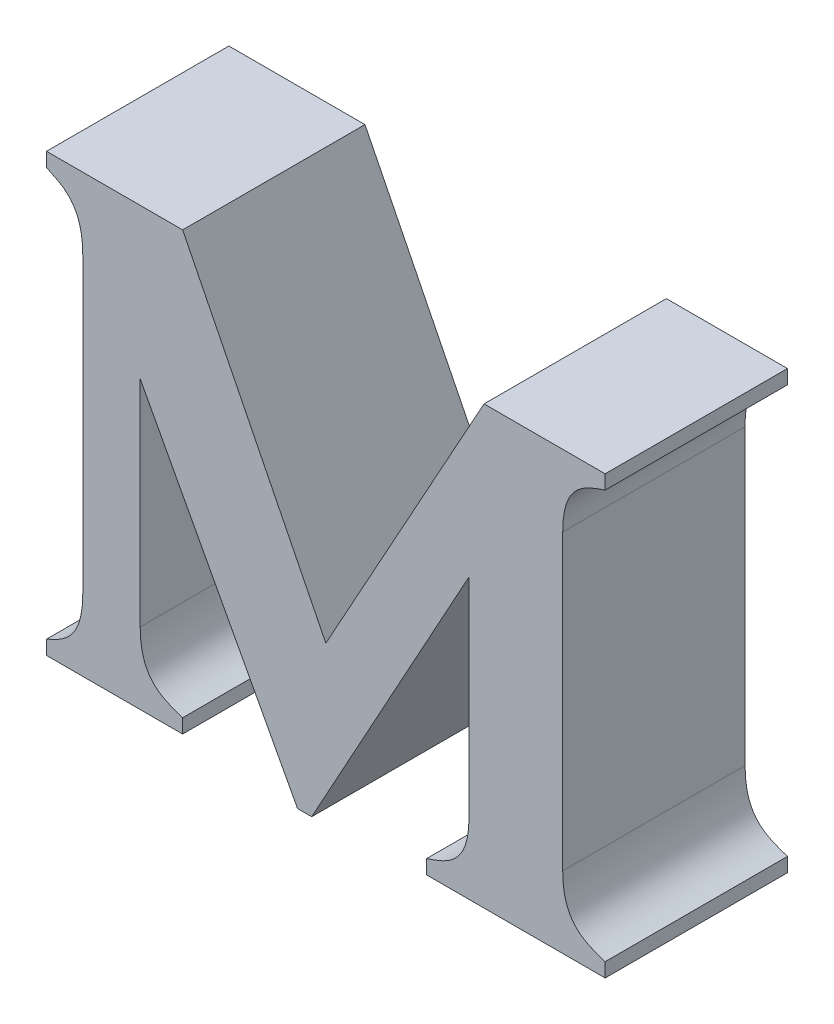
ISO-10303-21;
HEADER;
FILE_DESCRIPTION(('STEP AP214'),'2;1');
FILE_NAME('part.step','',(''),(''),'','','');
FILE_SCHEMA(('AUTOMOTIVE_DESIGN { 1 0 10303 214 1 1 1 1 }'));
ENDSEC;
DATA;
#1=APPLICATION_CONTEXT('core data for automotive mechanical design processes');
#2=APPLICATION_PROTOCOL_DEFINITION('international standard','automotive_design',2000,#1);
#3=PRODUCT_CONTEXT('',#1,'mechanical');
#4=PRODUCT('Part','Part','',(#3));
#5=PRODUCT_RELATED_PRODUCT_CATEGORY('part','',(#4));
#6=PRODUCT_DEFINITION_FORMATION('','',#4);
#7=PRODUCT_DEFINITION_CONTEXT('part definition',#1,'design');
#8=PRODUCT_DEFINITION('design','',#6,#7);
#9=PRODUCT_DEFINITION_SHAPE('','',#8);
#10=(LENGTH_UNIT() NAMED_UNIT(*) SI_UNIT(.MILLI.,.METRE.));
#11=(NAMED_UNIT(*) PLANE_ANGLE_UNIT() SI_UNIT($,.RADIAN.));
#12=(NAMED_UNIT(*) SI_UNIT($,.STERADIAN.) SOLID_ANGLE_UNIT());
#13=UNCERTAINTY_MEASURE_WITH_UNIT(LENGTH_MEASURE(1.E-05),#10,'distance_accuracy_value','');
#14=(GEOMETRIC_REPRESENTATION_CONTEXT(3) GLOBAL_UNCERTAINTY_ASSIGNED_CONTEXT((#13)) GLOBAL_UNIT_ASSIGNED_CONTEXT((#10,
#11,#12)) REPRESENTATION_CONTEXT('',''));
#15=CARTESIAN_POINT('',(0.,0.,0.));
#16=DIRECTION('',(0.,0.,1.));
#17=DIRECTION('',(1.,0.,0.));
#18=AXIS2_PLACEMENT_3D('',#15,#16,#17);
#19=CARTESIAN_POINT('',(3.4975712633282,-0.200329401425036,0.));
#20=CARTESIAN_POINT('',(3.4975712633282,-0.200329401425036,0.1));
#21=CARTESIAN_POINT('',(3.505812727957,-0.204207508825481,0.));
#22=CARTESIAN_POINT('',(3.505812727957,-0.204207508825481,0.1));
#23=CARTESIAN_POINT('',(3.5174478428155,-0.2080857603454,0.));
#24=CARTESIAN_POINT('',(3.5174478428155,-0.2080857603454,0.1));
#25=CARTESIAN_POINT('',(3.5174478428152,-0.231839582517053,0.));
#26=CARTESIAN_POINT('',(3.5174478428152,-0.231839582517053,0.1));
#27=B_SPLINE_SURFACE_WITH_KNOTS('',3,1,((#19,#20),(#21,#22),(#23,#24),(#25,#26)),.UNSPECIFIED.,
.F.,.F.,.F.,(4,4),(2,2),(-1.,0.),(0.,0.01),.UNSPECIFIED.);
#28=CARTESIAN_POINT('',(3.5174478428152,-0.231839582517053,0.));
#29=CARTESIAN_POINT('',(3.5174478428155,-0.2080857603454,0.));
#30=CARTESIAN_POINT('',(3.505812727957,-0.204207508825481,0.));
#31=CARTESIAN_POINT('',(3.4975712633282,-0.200329401425036,0.));
#32=B_SPLINE_CURVE_WITH_KNOTS('',3,(#28,#29,#30,#31),.UNSPECIFIED.,.F.,.F.,(4,4),(0.,1.),.UNSPECIFIED.);
#33=CARTESIAN_POINT('',(3.5174478428152,-0.231839582517053,0.));
#34=VERTEX_POINT('',#33);
#35=CARTESIAN_POINT('',(3.4975712633282,-0.200329401425036,0.));
#36=VERTEX_POINT('',#35);
#37=EDGE_CURVE('E11',#34,#36,#32,.T.);
#38=DIRECTION('',(0.,0.,1.));
#39=VECTOR('',#38,1.);
#40=CARTESIAN_POINT('',(3.5174478428152,-0.231839582517053,0.));
#41=LINE('',#40,#39);
#42=CARTESIAN_POINT('',(3.5174478428152,-0.231839582517053,0.1));
#43=VERTEX_POINT('',#42);
#44=EDGE_CURVE('E28',#34,#43,#41,.T.);
#45=CARTESIAN_POINT('',(3.4975712633282,-0.200329401425036,0.1));
#46=CARTESIAN_POINT('',(3.505812727957,-0.204207508825481,0.1));
#47=CARTESIAN_POINT('',(3.5174478428155,-0.2080857603454,0.1));
#48=CARTESIAN_POINT('',(3.5174478428152,-0.231839582517053,0.1));
#49=B_SPLINE_CURVE_WITH_KNOTS('',3,(#45,#46,#47,#48),.UNSPECIFIED.,.F.,.F.,(4,4),(-1.,0.),.UNSPECIFIED.);
#50=CARTESIAN_POINT('',(3.4975712633282,-0.200329401425036,0.1));
#51=VERTEX_POINT('',#50);
#52=EDGE_CURVE('E206',#51,#43,#49,.T.);
#53=DIRECTION('',(0.,0.,1.));
#54=VECTOR('',#53,1.);
#55=CARTESIAN_POINT('',(3.4975712633282,-0.200329401425036,0.));
#56=LINE('',#55,#54);
#57=EDGE_CURVE('E433',#36,#51,#56,.T.);
#58=ORIENTED_EDGE('',*,*,#37,.F.);
#59=ORIENTED_EDGE('',*,*,#44,.T.);
#60=ORIENTED_EDGE('',*,*,#52,.F.);
#61=ORIENTED_EDGE('',*,*,#57,.F.);
#62=EDGE_LOOP('',(#58,#59,#60,#61));
#63=FACE_BOUND('',#62,.T.);
#64=ADVANCED_FACE('F17',(#63),#27,.T.);
#65=CARTESIAN_POINT('',(3.4975712633282,-0.19257300647474,0.));
#66=DIRECTION('',(-1.,0.,0.));
#67=DIRECTION('',(0.,-1.,0.));
#68=AXIS2_PLACEMENT_3D('',#65,#66,#67);
#69=PLANE('',#68);
#70=DIRECTION('',(0.,1.,0.));
#71=VECTOR('',#70,1.);
#72=CARTESIAN_POINT('',(3.4975712633282,-0.200329401425036,0.));
#73=LINE('',#72,#71);
#74=CARTESIAN_POINT('',(3.4975712633282,-0.19257300647474,0.));
#75=VERTEX_POINT('',#74);
#76=EDGE_CURVE('E431',#36,#75,#73,.T.);
#77=ORIENTED_EDGE('',*,*,#76,.F.);
#78=ORIENTED_EDGE('',*,*,#57,.T.);
#79=DIRECTION('',(0.,-1.,0.));
#80=VECTOR('',#79,1.);
#81=CARTESIAN_POINT('',(3.4975712633282,-0.200329401425036,0.1));
#82=LINE('',#81,#80);
#83=CARTESIAN_POINT('',(3.4975712633282,-0.19257300647474,0.1));
#84=VERTEX_POINT('',#83);
#85=EDGE_CURVE('E429',#84,#51,#82,.T.);
#86=ORIENTED_EDGE('',*,*,#85,.F.);
#87=DIRECTION('',(0.,0.,1.));
#88=VECTOR('',#87,1.);
#89=CARTESIAN_POINT('',(3.4975712633282,-0.19257300647474,0.));
#90=LINE('',#89,#88);
#91=EDGE_CURVE('E426',#75,#84,#90,.T.);
#92=ORIENTED_EDGE('',*,*,#91,.F.);
#93=EDGE_LOOP('',(#77,#78,#86,#92));
#94=FACE_BOUND('',#93,.T.);
#95=ADVANCED_FACE('F528',(#94),#69,.T.);
#96=CARTESIAN_POINT('',(3.5722265241914,-0.19257300647474,0.));
#97=DIRECTION('',(0.,1.,0.));
#98=DIRECTION('',(-1.,0.,0.));
#99=AXIS2_PLACEMENT_3D('',#96,#97,#98);
#100=PLANE('',#99);
#101=DIRECTION('',(1.,0.,0.));
#102=VECTOR('',#101,1.);
#103=CARTESIAN_POINT('',(3.4975712633282,-0.19257300647474,0.));
#104=LINE('',#103,#102);
#105=CARTESIAN_POINT('',(3.5722265241914,-0.19257300647474,0.));
#106=VERTEX_POINT('',#105);
#107=EDGE_CURVE('E424',#75,#106,#104,.T.);
#108=ORIENTED_EDGE('',*,*,#107,.F.);
#109=ORIENTED_EDGE('',*,*,#91,.T.);
#110=DIRECTION('',(-1.,0.,0.));
#111=VECTOR('',#110,1.);
#112=CARTESIAN_POINT('',(3.4975712633282,-0.19257300647474,0.1));
#113=LINE('',#112,#111);
#114=CARTESIAN_POINT('',(3.5722265241914,-0.19257300647474,0.1));
#115=VERTEX_POINT('',#114);
#116=EDGE_CURVE('E421',#115,#84,#113,.T.);
#117=ORIENTED_EDGE('',*,*,#116,.F.);
#118=DIRECTION('',(0.,0.,1.));
#119=VECTOR('',#118,1.);
#120=CARTESIAN_POINT('',(3.5722265241914,-0.19257300647474,0.));
#121=LINE('',#120,#119);
#122=EDGE_CURVE('E418',#106,#115,#121,.T.);
#123=ORIENTED_EDGE('',*,*,#122,.F.);
#124=EDGE_LOOP('',(#108,#109,#117,#123));
#125=FACE_BOUND('',#124,.T.);
#126=ADVANCED_FACE('F524',(#125),#100,.T.);
#127=CARTESIAN_POINT('',(3.6507596762761,-0.349639310644154,0.));
#128=DIRECTION('',(0.894427190999943,0.447213595499905,0.));
#129=DIRECTION('',(-0.447213595499905,0.894427190999943,0.));
#130=AXIS2_PLACEMENT_3D('',#127,#128,#129);
#131=PLANE('',#130);
#132=DIRECTION('',(0.447213595499904,-0.894427190999943,0.));
#133=VECTOR('',#132,1.);
#134=CARTESIAN_POINT('',(3.5722265241914,-0.19257300647474,0.));
#135=LINE('',#134,#133);
#136=CARTESIAN_POINT('',(3.6507596762761,-0.349639310644154,0.));
#137=VERTEX_POINT('',#136);
#138=EDGE_CURVE('E416',#106,#137,#135,.T.);
#139=ORIENTED_EDGE('',*,*,#138,.F.);
#140=ORIENTED_EDGE('',*,*,#122,.T.);
#141=DIRECTION('',(-0.447213595499904,0.894427190999943,0.));
#142=VECTOR('',#141,1.);
#143=CARTESIAN_POINT('',(3.5722265241914,-0.19257300647474,0.1));
#144=LINE('',#143,#142);
#145=CARTESIAN_POINT('',(3.6507596762761,-0.349639310644154,0.1));
#146=VERTEX_POINT('',#145);
#147=EDGE_CURVE('E413',#146,#115,#144,.T.);
#148=ORIENTED_EDGE('',*,*,#147,.F.);
#149=DIRECTION('',(0.,0.,1.));
#150=VECTOR('',#149,1.);
#151=CARTESIAN_POINT('',(3.6507596762761,-0.349639310644154,0.));
#152=LINE('',#151,#150);
#153=EDGE_CURVE('E410',#137,#146,#152,.T.);
#154=ORIENTED_EDGE('',*,*,#153,.F.);
#155=EDGE_LOOP('',(#139,#140,#148,#154));
#156=FACE_BOUND('',#155,.T.);
#157=ADVANCED_FACE('F520',(#156),#131,.T.);
#158=CARTESIAN_POINT('',(3.7375339326907,-0.19257300647474,0.));
#159=DIRECTION('',(-0.875301790518291,0.483577062644077,0.));
#160=DIRECTION('',(-0.483577062644077,-0.875301790518291,0.));
#161=AXIS2_PLACEMENT_3D('',#158,#159,#160);
#162=PLANE('',#161);
#163=DIRECTION('',(0.483577062644076,0.875301790518292,0.));
#164=VECTOR('',#163,1.);
#165=CARTESIAN_POINT('',(3.6507596762761,-0.349639310644154,0.));
#166=LINE('',#165,#164);
#167=CARTESIAN_POINT('',(3.7375339326907,-0.19257300647474,0.));
#168=VERTEX_POINT('',#167);
#169=EDGE_CURVE('E408',#137,#168,#166,.T.);
#170=ORIENTED_EDGE('',*,*,#169,.F.);
#171=ORIENTED_EDGE('',*,*,#153,.T.);
#172=DIRECTION('',(-0.483577062644076,-0.875301790518292,0.));
#173=VECTOR('',#172,1.);
#174=CARTESIAN_POINT('',(3.6507596762761,-0.349639310644154,0.1));
#175=LINE('',#174,#173);
#176=CARTESIAN_POINT('',(3.7375339326907,-0.19257300647474,0.1));
#177=VERTEX_POINT('',#176);
#178=EDGE_CURVE('E405',#177,#146,#175,.T.);
#179=ORIENTED_EDGE('',*,*,#178,.F.);
#180=DIRECTION('',(0.,0.,1.));
#181=VECTOR('',#180,1.);
#182=CARTESIAN_POINT('',(3.7375339326907,-0.19257300647474,0.));
#183=LINE('',#182,#181);
#184=EDGE_CURVE('E402',#168,#177,#183,.T.);
#185=ORIENTED_EDGE('',*,*,#184,.F.);
#186=EDGE_LOOP('',(#170,#171,#179,#185));
#187=FACE_BOUND('',#186,.T.);
#188=ADVANCED_FACE('F516',(#187),#162,.T.);
#189=CARTESIAN_POINT('',(3.8039477289253,-0.19257300647474,0.));
#190=DIRECTION('',(0.,1.,0.));
#191=DIRECTION('',(-1.,0.,0.));
#192=AXIS2_PLACEMENT_3D('',#189,#190,#191);
#193=PLANE('',#192);
#194=DIRECTION('',(1.,0.,0.));
#195=VECTOR('',#194,1.);
#196=CARTESIAN_POINT('',(3.7375339326907,-0.19257300647474,0.));
#197=LINE('',#196,#195);
#198=CARTESIAN_POINT('',(3.8039477289253,-0.19257300647474,0.));
#199=VERTEX_POINT('',#198);
#200=EDGE_CURVE('E400',#168,#199,#197,.T.);
#201=ORIENTED_EDGE('',*,*,#200,.F.);
#202=ORIENTED_EDGE('',*,*,#184,.T.);
#203=DIRECTION('',(-1.,0.,0.));
#204=VECTOR('',#203,1.);
#205=CARTESIAN_POINT('',(3.7375339326907,-0.19257300647474,0.1));
#206=LINE('',#205,#204);
#207=CARTESIAN_POINT('',(3.8039477289253,-0.19257300647474,0.1));
#208=VERTEX_POINT('',#207);
#209=EDGE_CURVE('E397',#208,#177,#206,.T.);
#210=ORIENTED_EDGE('',*,*,#209,.F.);
#211=DIRECTION('',(0.,0.,1.));
#212=VECTOR('',#211,1.);
#213=CARTESIAN_POINT('',(3.8039477289253,-0.19257300647474,0.));
#214=LINE('',#213,#212);
#215=EDGE_CURVE('E394',#199,#208,#214,.T.);
#216=ORIENTED_EDGE('',*,*,#215,.F.);
#217=EDGE_LOOP('',(#201,#202,#210,#216));
#218=FACE_BOUND('',#217,.T.);
#219=ADVANCED_FACE('F512',(#218),#193,.T.);
#220=CARTESIAN_POINT('',(3.8039477289253,-0.200329401425036,0.));
#221=DIRECTION('',(1.,0.,0.));
#222=DIRECTION('',(0.,1.,0.));
#223=AXIS2_PLACEMENT_3D('',#220,#221,#222);
#224=PLANE('',#223);
#225=DIRECTION('',(0.,-1.,0.));
#226=VECTOR('',#225,1.);
#227=CARTESIAN_POINT('',(3.8039477289253,-0.19257300647474,0.));
#228=LINE('',#227,#226);
#229=CARTESIAN_POINT('',(3.8039477289253,-0.200329401425036,0.));
#230=VERTEX_POINT('',#229);
#231=EDGE_CURVE('E392',#199,#230,#228,.T.);
#232=ORIENTED_EDGE('',*,*,#231,.F.);
#233=ORIENTED_EDGE('',*,*,#215,.T.);
#234=DIRECTION('',(0.,1.,0.));
#235=VECTOR('',#234,1.);
#236=CARTESIAN_POINT('',(3.8039477289253,-0.19257300647474,0.1));
#237=LINE('',#236,#235);
#238=CARTESIAN_POINT('',(3.8039477289253,-0.200329401425036,0.1));
#239=VERTEX_POINT('',#238);
#240=EDGE_CURVE('E389',#239,#208,#237,.T.);
#241=ORIENTED_EDGE('',*,*,#240,.F.);
#242=DIRECTION('',(0.,0.,1.));
#243=VECTOR('',#242,1.);
#244=CARTESIAN_POINT('',(3.8039477289253,-0.200329401425036,0.));
#245=LINE('',#244,#243);
#246=EDGE_CURVE('E383',#230,#239,#245,.T.);
#247=ORIENTED_EDGE('',*,*,#246,.F.);
#248=EDGE_LOOP('',(#232,#233,#241,#247));
#249=FACE_BOUND('',#248,.T.);
#250=ADVANCED_FACE('F508',(#249),#224,.T.);
#251=CARTESIAN_POINT('',(3.7806789404027,-0.231839582517053,0.));
#252=CARTESIAN_POINT('',(3.7806789404027,-0.231839582517053,0.1));
#253=CARTESIAN_POINT('',(3.7806789405178,-0.208085760692206,0.));
#254=CARTESIAN_POINT('',(3.7806789405178,-0.208085760692206,0.1));
#255=CARTESIAN_POINT('',(3.7923126141248,-0.204207508998979,0.));
#256=CARTESIAN_POINT('',(3.7923126141248,-0.204207508998979,0.1));
#257=CARTESIAN_POINT('',(3.8039477289253,-0.200329401425036,0.));
#258=CARTESIAN_POINT('',(3.8039477289253,-0.200329401425036,0.1));
#259=B_SPLINE_SURFACE_WITH_KNOTS('',3,1,((#251,#252),(#253,#254),(#255,#256),(#257,#258)),
.UNSPECIFIED.,.F.,.F.,.F.,(4,4),(2,2),(-1.,0.),(0.,0.01),.UNSPECIFIED.);
#260=CARTESIAN_POINT('',(3.8039477289253,-0.200329401425036,0.));
#261=CARTESIAN_POINT('',(3.7923126141248,-0.204207508998979,0.));
#262=CARTESIAN_POINT('',(3.7806789405178,-0.208085760692206,0.));
#263=CARTESIAN_POINT('',(3.7806789404027,-0.231839582517053,0.));
#264=B_SPLINE_CURVE_WITH_KNOTS('',3,(#260,#261,#262,#263),.UNSPECIFIED.,.F.,.F.,(4,4),(0.,1.),.UNSPECIFIED.);
#265=CARTESIAN_POINT('',(3.7806789404027,-0.231839582517053,0.));
#266=VERTEX_POINT('',#265);
#267=EDGE_CURVE('E376',#230,#266,#264,.T.);
#268=CARTESIAN_POINT('',(3.7806789404027,-0.231839582517053,0.1));
#269=CARTESIAN_POINT('',(3.7806789405178,-0.208085760692206,0.1));
#270=CARTESIAN_POINT('',(3.7923126141248,-0.204207508998979,0.1));
#271=CARTESIAN_POINT('',(3.8039477289253,-0.200329401425036,0.1));
#272=B_SPLINE_CURVE_WITH_KNOTS('',3,(#268,#269,#270,#271),.UNSPECIFIED.,.F.,.F.,(4,4),(-1.,0.),.UNSPECIFIED.);
#273=CARTESIAN_POINT('',(3.7806789404027,-0.231839582517053,0.1));
#274=VERTEX_POINT('',#273);
#275=EDGE_CURVE('E371',#274,#239,#272,.T.);
#276=DIRECTION('',(0.,0.,1.));
#277=VECTOR('',#276,1.);
#278=CARTESIAN_POINT('',(3.7806789404027,-0.231839582517053,0.));
#279=LINE('',#278,#277);
#280=EDGE_CURVE('E368',#266,#274,#279,.T.);
#281=ORIENTED_EDGE('',*,*,#267,.F.);
#282=ORIENTED_EDGE('',*,*,#246,.T.);
#283=ORIENTED_EDGE('',*,*,#275,.F.);
#284=ORIENTED_EDGE('',*,*,#280,.F.);
#285=EDGE_LOOP('',(#281,#282,#283,#284));
#286=FACE_BOUND('',#285,.T.);
#287=ADVANCED_FACE('F504',(#286),#259,.T.);
#288=CARTESIAN_POINT('',(3.7806789404027,-0.392784138206144,0.));
#289=DIRECTION('',(1.,0.,0.));
#290=DIRECTION('',(0.,1.,0.));
#291=AXIS2_PLACEMENT_3D('',#288,#289,#290);
#292=PLANE('',#291);
#293=DIRECTION('',(0.,-1.,0.));
#294=VECTOR('',#293,1.);
#295=CARTESIAN_POINT('',(3.7806789404027,-0.231839582517053,0.));
#296=LINE('',#295,#294);
#297=CARTESIAN_POINT('',(3.7806789404027,-0.392784138206144,0.));
#298=VERTEX_POINT('',#297);
#299=EDGE_CURVE('E366',#266,#298,#296,.T.);
#300=ORIENTED_EDGE('',*,*,#299,.F.);
#301=ORIENTED_EDGE('',*,*,#280,.T.);
#302=DIRECTION('',(0.,1.,0.));
#303=VECTOR('',#302,1.);
#304=CARTESIAN_POINT('',(3.7806789404027,-0.231839582517053,0.1));
#305=LINE('',#304,#303);
#306=CARTESIAN_POINT('',(3.7806789404027,-0.392784138206144,0.1));
#307=VERTEX_POINT('',#306);
#308=EDGE_CURVE('E363',#307,#274,#305,.T.);
#309=ORIENTED_EDGE('',*,*,#308,.F.);
#310=DIRECTION('',(0.,0.,1.));
#311=VECTOR('',#310,1.);
#312=CARTESIAN_POINT('',(3.7806789404027,-0.392784138206144,0.));
#313=LINE('',#312,#311);
#314=EDGE_CURVE('E357',#298,#307,#313,.T.);
#315=ORIENTED_EDGE('',*,*,#314,.F.);
#316=EDGE_LOOP('',(#300,#301,#309,#315));
#317=FACE_BOUND('',#316,.T.);
#318=ADVANCED_FACE('F500',(#317),#292,.T.);
#319=CARTESIAN_POINT('',(3.8039477289253,-0.424294319298148,0.));
#320=CARTESIAN_POINT('',(3.8039477289253,-0.424294319298148,0.1));
#321=CARTESIAN_POINT('',(3.7923126138965,-0.42041606784963,0.));
#322=CARTESIAN_POINT('',(3.7923126138965,-0.42041606784963,0.1));
#323=CARTESIAN_POINT('',(3.7806789402565,-0.416537924348321,0.));
#324=CARTESIAN_POINT('',(3.7806789402565,-0.416537924348321,0.1));
#325=CARTESIAN_POINT('',(3.7806789404027,-0.392784138206144,0.));
#326=CARTESIAN_POINT('',(3.7806789404027,-0.392784138206144,0.1));
#327=B_SPLINE_SURFACE_WITH_KNOTS('',3,1,((#319,#320),(#321,#322),(#323,#324),(#325,#326)),
.UNSPECIFIED.,.F.,.F.,.F.,(4,4),(2,2),(-1.,0.),(0.,0.01),.UNSPECIFIED.);
#328=CARTESIAN_POINT('',(3.7806789404027,-0.392784138206144,0.));
#329=CARTESIAN_POINT('',(3.7806789402565,-0.416537924348321,0.));
#330=CARTESIAN_POINT('',(3.7923126138965,-0.42041606784963,0.));
#331=CARTESIAN_POINT('',(3.8039477289253,-0.424294319298148,0.));
#332=B_SPLINE_CURVE_WITH_KNOTS('',3,(#328,#329,#330,#331),.UNSPECIFIED.,.F.,.F.,(4,4),(0.,1.),.UNSPECIFIED.);
#333=CARTESIAN_POINT('',(3.8039477289253,-0.424294319298148,0.));
#334=VERTEX_POINT('',#333);
#335=EDGE_CURVE('E350',#298,#334,#332,.T.);
#336=CARTESIAN_POINT('',(3.8039477289253,-0.424294319298148,0.1));
#337=CARTESIAN_POINT('',(3.7923126138965,-0.42041606784963,0.1));
#338=CARTESIAN_POINT('',(3.7806789402565,-0.416537924348321,0.1));
#339=CARTESIAN_POINT('',(3.7806789404027,-0.392784138206144,0.1));
#340=B_SPLINE_CURVE_WITH_KNOTS('',3,(#336,#337,#338,#339),.UNSPECIFIED.,.F.,.F.,(4,4),(-1.,0.),.UNSPECIFIED.);
#341=CARTESIAN_POINT('',(3.8039477289253,-0.424294319298148,0.1));
#342=VERTEX_POINT('',#341);
#343=EDGE_CURVE('E345',#342,#307,#340,.T.);
#344=DIRECTION('',(0.,0.,1.));
#345=VECTOR('',#344,1.);
#346=CARTESIAN_POINT('',(3.8039477289253,-0.424294319298148,0.));
#347=LINE('',#346,#345);
#348=EDGE_CURVE('E342',#334,#342,#347,.T.);
#349=ORIENTED_EDGE('',*,*,#335,.F.);
#350=ORIENTED_EDGE('',*,*,#314,.T.);
#351=ORIENTED_EDGE('',*,*,#343,.F.);
#352=ORIENTED_EDGE('',*,*,#348,.F.);
#353=EDGE_LOOP('',(#349,#350,#351,#352));
#354=FACE_BOUND('',#353,.T.);
#355=ADVANCED_FACE('F496',(#354),#327,.T.);
#356=CARTESIAN_POINT('',(3.8039477289253,-0.432050714249068,0.));
#357=DIRECTION('',(1.,0.,0.));
#358=DIRECTION('',(0.,1.,0.));
#359=AXIS2_PLACEMENT_3D('',#356,#357,#358);
#360=PLANE('',#359);
#361=DIRECTION('',(0.,-1.,0.));
#362=VECTOR('',#361,1.);
#363=CARTESIAN_POINT('',(3.8039477289253,-0.424294319298148,0.));
#364=LINE('',#363,#362);
#365=CARTESIAN_POINT('',(3.8039477289253,-0.432050714249068,0.));
#366=VERTEX_POINT('',#365);
#367=EDGE_CURVE('E340',#334,#366,#364,.T.);
#368=ORIENTED_EDGE('',*,*,#367,.F.);
#369=ORIENTED_EDGE('',*,*,#348,.T.);
#370=DIRECTION('',(0.,1.,0.));
#371=VECTOR('',#370,1.);
#372=CARTESIAN_POINT('',(3.8039477289253,-0.424294319298148,0.1));
#373=LINE('',#372,#371);
#374=CARTESIAN_POINT('',(3.8039477289253,-0.432050714249068,0.1));
#375=VERTEX_POINT('',#374);
#376=EDGE_CURVE('E337',#375,#342,#373,.T.);
#377=ORIENTED_EDGE('',*,*,#376,.F.);
#378=DIRECTION('',(0.,0.,1.));
#379=VECTOR('',#378,1.);
#380=CARTESIAN_POINT('',(3.8039477289253,-0.432050714249068,0.));
#381=LINE('',#380,#379);
#382=EDGE_CURVE('E334',#366,#375,#381,.T.);
#383=ORIENTED_EDGE('',*,*,#382,.F.);
#384=EDGE_LOOP('',(#368,#369,#377,#383));
#385=FACE_BOUND('',#384,.T.);
#386=ADVANCED_FACE('F492',(#385),#360,.T.);
#387=CARTESIAN_POINT('',(3.7060236795394,-0.432050714249068,0.));
#388=DIRECTION('',(0.,-1.,0.));
#389=DIRECTION('',(1.,0.,0.));
#390=AXIS2_PLACEMENT_3D('',#387,#388,#389);
#391=PLANE('',#390);
#392=DIRECTION('',(-1.,0.,0.));
#393=VECTOR('',#392,1.);
#394=CARTESIAN_POINT('',(3.8039477289253,-0.432050714249068,0.));
#395=LINE('',#394,#393);
#396=CARTESIAN_POINT('',(3.7060236795394,-0.432050714249068,0.));
#397=VERTEX_POINT('',#396);
#398=EDGE_CURVE('E332',#366,#397,#395,.T.);
#399=ORIENTED_EDGE('',*,*,#398,.F.);
#400=ORIENTED_EDGE('',*,*,#382,.T.);
#401=DIRECTION('',(1.,0.,0.));
#402=VECTOR('',#401,1.);
#403=CARTESIAN_POINT('',(3.8039477289253,-0.432050714249068,0.1));
#404=LINE('',#403,#402);
#405=CARTESIAN_POINT('',(3.7060236795394,-0.432050714249068,0.1));
#406=VERTEX_POINT('',#405);
#407=EDGE_CURVE('E329',#406,#375,#404,.T.);
#408=ORIENTED_EDGE('',*,*,#407,.F.);
#409=DIRECTION('',(0.,0.,1.));
#410=VECTOR('',#409,1.);
#411=CARTESIAN_POINT('',(3.7060236795394,-0.432050714249068,0.));
#412=LINE('',#411,#410);
#413=EDGE_CURVE('E326',#397,#406,#412,.T.);
#414=ORIENTED_EDGE('',*,*,#413,.F.);
#415=EDGE_LOOP('',(#399,#400,#408,#414));
#416=FACE_BOUND('',#415,.T.);
#417=ADVANCED_FACE('F488',(#416),#391,.T.);
#418=CARTESIAN_POINT('',(3.7060236795394,-0.424294319298148,0.));
#419=DIRECTION('',(-1.,0.,0.));
#420=DIRECTION('',(0.,-1.,0.));
#421=AXIS2_PLACEMENT_3D('',#418,#419,#420);
#422=PLANE('',#421);
#423=DIRECTION('',(0.,1.,0.));
#424=VECTOR('',#423,1.);
#425=CARTESIAN_POINT('',(3.7060236795394,-0.432050714249068,0.));
#426=LINE('',#425,#424);
#427=CARTESIAN_POINT('',(3.7060236795394,-0.424294319298148,0.));
#428=VERTEX_POINT('',#427);
#429=EDGE_CURVE('E324',#397,#428,#426,.T.);
#430=ORIENTED_EDGE('',*,*,#429,.F.);
#431=ORIENTED_EDGE('',*,*,#413,.T.);
#432=DIRECTION('',(0.,-1.,0.));
#433=VECTOR('',#432,1.);
#434=CARTESIAN_POINT('',(3.7060236795394,-0.432050714249068,0.1));
#435=LINE('',#434,#433);
#436=CARTESIAN_POINT('',(3.7060236795394,-0.424294319298148,0.1));
#437=VERTEX_POINT('',#436);
#438=EDGE_CURVE('E321',#437,#406,#435,.T.);
#439=ORIENTED_EDGE('',*,*,#438,.F.);
#440=DIRECTION('',(0.,0.,1.));
#441=VECTOR('',#440,1.);
#442=CARTESIAN_POINT('',(3.7060236795394,-0.424294319298148,0.));
#443=LINE('',#442,#441);
#444=EDGE_CURVE('E315',#428,#437,#443,.T.);
#445=ORIENTED_EDGE('',*,*,#444,.F.);
#446=EDGE_LOOP('',(#430,#431,#439,#445));
#447=FACE_BOUND('',#446,.T.);
#448=ADVANCED_FACE('F484',(#447),#422,.T.);
#449=CARTESIAN_POINT('',(3.729292468062,-0.392784138206144,0.));
#450=CARTESIAN_POINT('',(3.729292468062,-0.392784138206144,0.1));
#451=CARTESIAN_POINT('',(3.7292924679462,-0.416537924001519,0.));
#452=CARTESIAN_POINT('',(3.7292924679462,-0.416537924001519,0.1));
#453=CARTESIAN_POINT('',(3.7176587943397,-0.420416067604473,0.));
#454=CARTESIAN_POINT('',(3.7176587943397,-0.420416067604473,0.1));
#455=CARTESIAN_POINT('',(3.7060236795394,-0.424294319298148,0.));
#456=CARTESIAN_POINT('',(3.7060236795394,-0.424294319298148,0.1));
#457=B_SPLINE_SURFACE_WITH_KNOTS('',3,1,((#449,#450),(#451,#452),(#453,#454),(#455,#456)),
.UNSPECIFIED.,.F.,.F.,.F.,(4,4),(2,2),(-1.,0.),(0.,0.01),.UNSPECIFIED.);
#458=CARTESIAN_POINT('',(3.7060236795394,-0.424294319298148,0.));
#459=CARTESIAN_POINT('',(3.7176587943397,-0.420416067604473,0.));
#460=CARTESIAN_POINT('',(3.7292924679462,-0.416537924001519,0.));
#461=CARTESIAN_POINT('',(3.729292468062,-0.392784138206144,0.));
#462=B_SPLINE_CURVE_WITH_KNOTS('',3,(#458,#459,#460,#461),.UNSPECIFIED.,.F.,.F.,(4,4),(0.,1.),.UNSPECIFIED.);
#463=CARTESIAN_POINT('',(3.729292468062,-0.392784138206144,0.));
#464=VERTEX_POINT('',#463);
#465=EDGE_CURVE('E308',#428,#464,#462,.T.);
#466=CARTESIAN_POINT('',(3.729292468062,-0.392784138206144,0.1));
#467=CARTESIAN_POINT('',(3.7292924679462,-0.416537924001519,0.1));
#468=CARTESIAN_POINT('',(3.7176587943397,-0.420416067604473,0.1));
#469=CARTESIAN_POINT('',(3.7060236795394,-0.424294319298148,0.1));
#470=B_SPLINE_CURVE_WITH_KNOTS('',3,(#466,#467,#468,#469),.UNSPECIFIED.,.F.,.F.,(4,4),(-1.,0.),.UNSPECIFIED.);
#471=CARTESIAN_POINT('',(3.729292468062,-0.392784138206144,0.1));
#472=VERTEX_POINT('',#471);
#473=EDGE_CURVE('E303',#472,#437,#470,.T.);
#474=DIRECTION('',(0.,0.,1.));
#475=VECTOR('',#474,1.);
#476=CARTESIAN_POINT('',(3.729292468062,-0.392784138206144,0.));
#477=LINE('',#476,#475);
#478=EDGE_CURVE('E300',#464,#472,#477,.T.);
#479=ORIENTED_EDGE('',*,*,#465,.F.);
#480=ORIENTED_EDGE('',*,*,#444,.T.);
#481=ORIENTED_EDGE('',*,*,#473,.F.);
#482=ORIENTED_EDGE('',*,*,#478,.F.);
#483=EDGE_LOOP('',(#479,#480,#481,#482));
#484=FACE_BOUND('',#483,.T.);
#485=ADVANCED_FACE('F480',(#484),#457,.T.);
#486=CARTESIAN_POINT('',(3.729292468062,-0.278862517480154,0.));
#487=DIRECTION('',(-1.,0.,0.));
#488=DIRECTION('',(0.,-1.,0.));
#489=AXIS2_PLACEMENT_3D('',#486,#487,#488);
#490=PLANE('',#489);
#491=DIRECTION('',(0.,1.,0.));
#492=VECTOR('',#491,1.);
#493=CARTESIAN_POINT('',(3.729292468062,-0.392784138206144,0.));
#494=LINE('',#493,#492);
#495=CARTESIAN_POINT('',(3.729292468062,-0.278862517480154,0.));
#496=VERTEX_POINT('',#495);
#497=EDGE_CURVE('E298',#464,#496,#494,.T.);
#498=ORIENTED_EDGE('',*,*,#497,.F.);
#499=ORIENTED_EDGE('',*,*,#478,.T.);
#500=DIRECTION('',(0.,-1.,0.));
#501=VECTOR('',#500,1.);
#502=CARTESIAN_POINT('',(3.729292468062,-0.392784138206144,0.1));
#503=LINE('',#502,#501);
#504=CARTESIAN_POINT('',(3.729292468062,-0.278862517480154,0.1));
#505=VERTEX_POINT('',#504);
#506=EDGE_CURVE('E295',#505,#472,#503,.T.);
#507=ORIENTED_EDGE('',*,*,#506,.F.);
#508=DIRECTION('',(0.,0.,1.));
#509=VECTOR('',#508,1.);
#510=CARTESIAN_POINT('',(3.729292468062,-0.278862517480154,0.));
#511=LINE('',#510,#509);
#512=EDGE_CURVE('E292',#496,#505,#511,.T.);
#513=ORIENTED_EDGE('',*,*,#512,.F.);
#514=EDGE_LOOP('',(#498,#499,#507,#513));
#515=FACE_BOUND('',#514,.T.);
#516=ADVANCED_FACE('F476',(#515),#490,.T.);
#517=CARTESIAN_POINT('',(3.6430031732357,-0.435928821649544,0.));
#518=DIRECTION('',(0.876444775107035,-0.481502394789039,0.));
#519=DIRECTION('',(0.481502394789039,0.876444775107035,0.));
#520=AXIS2_PLACEMENT_3D('',#517,#518,#519);
#521=PLANE('',#520);
#522=DIRECTION('',(-0.481502394789039,-0.876444775107035,0.));
#523=VECTOR('',#522,1.);
#524=CARTESIAN_POINT('',(3.729292468062,-0.278862517480154,0.));
#525=LINE('',#524,#523);
#526=CARTESIAN_POINT('',(3.6430031732357,-0.435928821649544,0.));
#527=VERTEX_POINT('',#526);
#528=EDGE_CURVE('E290',#496,#527,#525,.T.);
#529=ORIENTED_EDGE('',*,*,#528,.F.);
#530=ORIENTED_EDGE('',*,*,#512,.T.);
#531=DIRECTION('',(0.481502394789039,0.876444775107035,0.));
#532=VECTOR('',#531,1.);
#533=CARTESIAN_POINT('',(3.729292468062,-0.278862517480154,0.1));
#534=LINE('',#533,#532);
#535=CARTESIAN_POINT('',(3.6430031732357,-0.435928821649544,0.1));
#536=VERTEX_POINT('',#535);
#537=EDGE_CURVE('E287',#536,#505,#534,.T.);
#538=ORIENTED_EDGE('',*,*,#537,.F.);
#539=DIRECTION('',(0.,0.,1.));
#540=VECTOR('',#539,1.);
#541=CARTESIAN_POINT('',(3.6430031732357,-0.435928821649544,0.));
#542=LINE('',#541,#540);
#543=EDGE_CURVE('E284',#527,#536,#542,.T.);
#544=ORIENTED_EDGE('',*,*,#543,.F.);
#545=EDGE_LOOP('',(#529,#530,#538,#544));
#546=FACE_BOUND('',#545,.T.);
#547=ADVANCED_FACE('F472',(#546),#521,.T.);
#548=CARTESIAN_POINT('',(3.635247030494,-0.435928821649544,0.));
#549=DIRECTION('',(0.,-1.,0.));
#550=DIRECTION('',(1.,0.,0.));
#551=AXIS2_PLACEMENT_3D('',#548,#549,#550);
#552=PLANE('',#551);
#553=DIRECTION('',(-1.,0.,0.));
#554=VECTOR('',#553,1.);
#555=CARTESIAN_POINT('',(3.6430031732357,-0.435928821649544,0.));
#556=LINE('',#555,#554);
#557=CARTESIAN_POINT('',(3.635247030494,-0.435928821649544,0.));
#558=VERTEX_POINT('',#557);
#559=EDGE_CURVE('E282',#527,#558,#556,.T.);
#560=ORIENTED_EDGE('',*,*,#559,.F.);
#561=ORIENTED_EDGE('',*,*,#543,.T.);
#562=DIRECTION('',(1.,0.,0.));
#563=VECTOR('',#562,1.);
#564=CARTESIAN_POINT('',(3.6430031732357,-0.435928821649544,0.1));
#565=LINE('',#564,#563);
#566=CARTESIAN_POINT('',(3.635247030494,-0.435928821649544,0.1));
#567=VERTEX_POINT('',#566);
#568=EDGE_CURVE('E279',#567,#536,#565,.T.);
#569=ORIENTED_EDGE('',*,*,#568,.F.);
#570=DIRECTION('',(0.,0.,1.));
#571=VECTOR('',#570,1.);
#572=CARTESIAN_POINT('',(3.635247030494,-0.435928821649544,0.));
#573=LINE('',#572,#571);
#574=EDGE_CURVE('E276',#558,#567,#573,.T.);
#575=ORIENTED_EDGE('',*,*,#574,.F.);
#576=EDGE_LOOP('',(#560,#561,#569,#575));
#577=FACE_BOUND('',#576,.T.);
#578=ADVANCED_FACE('F468',(#577),#552,.T.);
#579=CARTESIAN_POINT('',(3.5489580959665,-0.274984410079678,0.));
#580=DIRECTION('',(-0.881323295859112,-0.472513754483435,0.));
#581=DIRECTION('',(0.472513754483435,-0.881323295859112,0.));
#582=AXIS2_PLACEMENT_3D('',#579,#580,#581);
#583=PLANE('',#582);
#584=DIRECTION('',(-0.472513754483435,0.881323295859112,0.));
#585=VECTOR('',#584,1.);
#586=CARTESIAN_POINT('',(3.635247030494,-0.435928821649544,0.));
#587=LINE('',#586,#585);
#588=CARTESIAN_POINT('',(3.5489580959665,-0.274984410079678,0.));
#589=VERTEX_POINT('',#588);
#590=EDGE_CURVE('E274',#558,#589,#587,.T.);
#591=ORIENTED_EDGE('',*,*,#590,.F.);
#592=ORIENTED_EDGE('',*,*,#574,.T.);
#593=DIRECTION('',(0.472513754483435,-0.881323295859112,0.));
#594=VECTOR('',#593,1.);
#595=CARTESIAN_POINT('',(3.635247030494,-0.435928821649544,0.1));
#596=LINE('',#595,#594);
#597=CARTESIAN_POINT('',(3.5489580959665,-0.274984410079678,0.1));
#598=VERTEX_POINT('',#597);
#599=EDGE_CURVE('E271',#598,#567,#596,.T.);
#600=ORIENTED_EDGE('',*,*,#599,.F.);
#601=DIRECTION('',(0.,0.,1.));
#602=VECTOR('',#601,1.);
#603=CARTESIAN_POINT('',(3.5489580959665,-0.274984410079678,0.));
#604=LINE('',#603,#602);
#605=EDGE_CURVE('E268',#589,#598,#604,.T.);
#606=ORIENTED_EDGE('',*,*,#605,.F.);
#607=EDGE_LOOP('',(#591,#592,#600,#606));
#608=FACE_BOUND('',#607,.T.);
#609=ADVANCED_FACE('F464',(#608),#583,.T.);
#610=CARTESIAN_POINT('',(3.5489580959665,-0.392784138206144,0.));
#611=DIRECTION('',(1.,0.,0.));
#612=DIRECTION('',(0.,1.,0.));
#613=AXIS2_PLACEMENT_3D('',#610,#611,#612);
#614=PLANE('',#613);
#615=DIRECTION('',(0.,-1.,0.));
#616=VECTOR('',#615,1.);
#617=CARTESIAN_POINT('',(3.5489580959665,-0.274984410079678,0.));
#618=LINE('',#617,#616);
#619=CARTESIAN_POINT('',(3.5489580959665,-0.392784138206144,0.));
#620=VERTEX_POINT('',#619);
#621=EDGE_CURVE('E266',#589,#620,#618,.T.);
#622=ORIENTED_EDGE('',*,*,#621,.F.);
#623=ORIENTED_EDGE('',*,*,#605,.T.);
#624=DIRECTION('',(0.,1.,0.));
#625=VECTOR('',#624,1.);
#626=CARTESIAN_POINT('',(3.5489580959665,-0.274984410079678,0.1));
#627=LINE('',#626,#625);
#628=CARTESIAN_POINT('',(3.5489580959665,-0.392784138206144,0.1));
#629=VERTEX_POINT('',#628);
#630=EDGE_CURVE('E263',#629,#598,#627,.T.);
#631=ORIENTED_EDGE('',*,*,#630,.F.);
#632=DIRECTION('',(0.,0.,1.));
#633=VECTOR('',#632,1.);
#634=CARTESIAN_POINT('',(3.5489580959665,-0.392784138206144,0.));
#635=LINE('',#634,#633);
#636=EDGE_CURVE('E257',#620,#629,#635,.T.);
#637=ORIENTED_EDGE('',*,*,#636,.F.);
#638=EDGE_LOOP('',(#622,#623,#631,#637));
#639=FACE_BOUND('',#638,.T.);
#640=ADVANCED_FACE('F460',(#639),#614,.T.);
#641=CARTESIAN_POINT('',(3.5722265241914,-0.424294319298148,0.));
#642=CARTESIAN_POINT('',(3.5722265241914,-0.424294319298148,0.1));
#643=CARTESIAN_POINT('',(3.5605914077565,-0.420416068441476,0.));
#644=CARTESIAN_POINT('',(3.5605914077565,-0.420416068441476,0.1));
#645=CARTESIAN_POINT('',(3.5489580946111,-0.41653792434832,0.));
#646=CARTESIAN_POINT('',(3.5489580946111,-0.41653792434832,0.1));
#647=CARTESIAN_POINT('',(3.5489580959665,-0.392784138206144,0.));
#648=CARTESIAN_POINT('',(3.5489580959665,-0.392784138206144,0.1));
#649=B_SPLINE_SURFACE_WITH_KNOTS('',3,1,((#641,#642),(#643,#644),(#645,#646),(#647,#648)),
.UNSPECIFIED.,.F.,.F.,.F.,(4,4),(2,2),(-1.,0.),(0.,0.01),.UNSPECIFIED.);
#650=CARTESIAN_POINT('',(3.5489580959665,-0.392784138206144,0.));
#651=CARTESIAN_POINT('',(3.5489580946111,-0.41653792434832,0.));
#652=CARTESIAN_POINT('',(3.5605914077565,-0.420416068441476,0.));
#653=CARTESIAN_POINT('',(3.5722265241914,-0.424294319298148,0.));
#654=B_SPLINE_CURVE_WITH_KNOTS('',3,(#650,#651,#652,#653),.UNSPECIFIED.,.F.,.F.,(4,4),(0.,1.),.UNSPECIFIED.);
#655=CARTESIAN_POINT('',(3.5722265241914,-0.424294319298148,0.));
#656=VERTEX_POINT('',#655);
#657=EDGE_CURVE('E250',#620,#656,#654,.T.);
#658=CARTESIAN_POINT('',(3.5722265241914,-0.424294319298148,0.1));
#659=CARTESIAN_POINT('',(3.5605914077565,-0.420416068441476,0.1));
#660=CARTESIAN_POINT('',(3.5489580946111,-0.41653792434832,0.1));
#661=CARTESIAN_POINT('',(3.5489580959665,-0.392784138206144,0.1));
#662=B_SPLINE_CURVE_WITH_KNOTS('',3,(#658,#659,#660,#661),.UNSPECIFIED.,.F.,.F.,(4,4),(-1.,0.),.UNSPECIFIED.);
#663=CARTESIAN_POINT('',(3.5722265241914,-0.424294319298148,0.1));
#664=VERTEX_POINT('',#663);
#665=EDGE_CURVE('E245',#664,#629,#662,.T.);
#666=DIRECTION('',(0.,0.,1.));
#667=VECTOR('',#666,1.);
#668=CARTESIAN_POINT('',(3.5722265241914,-0.424294319298148,0.));
#669=LINE('',#668,#667);
#670=EDGE_CURVE('E242',#656,#664,#669,.T.);
#671=ORIENTED_EDGE('',*,*,#657,.F.);
#672=ORIENTED_EDGE('',*,*,#636,.T.);
#673=ORIENTED_EDGE('',*,*,#665,.F.);
#674=ORIENTED_EDGE('',*,*,#670,.F.);
#675=EDGE_LOOP('',(#671,#672,#673,#674));
#676=FACE_BOUND('',#675,.T.);
#677=ADVANCED_FACE('F456',(#676),#649,.T.);
#678=CARTESIAN_POINT('',(3.5722265241914,-0.432050714249068,0.));
#679=DIRECTION('',(1.,0.,0.));
#680=DIRECTION('',(0.,1.,0.));
#681=AXIS2_PLACEMENT_3D('',#678,#679,#680);
#682=PLANE('',#681);
#683=DIRECTION('',(0.,-1.,0.));
#684=VECTOR('',#683,1.);
#685=CARTESIAN_POINT('',(3.5722265241914,-0.424294319298148,0.));
#686=LINE('',#685,#684);
#687=CARTESIAN_POINT('',(3.5722265241914,-0.432050714249068,0.));
#688=VERTEX_POINT('',#687);
#689=EDGE_CURVE('E240',#656,#688,#686,.T.);
#690=ORIENTED_EDGE('',*,*,#689,.F.);
#691=ORIENTED_EDGE('',*,*,#670,.T.);
#692=DIRECTION('',(0.,1.,0.));
#693=VECTOR('',#692,1.);
#694=CARTESIAN_POINT('',(3.5722265241914,-0.424294319298148,0.1));
#695=LINE('',#694,#693);
#696=CARTESIAN_POINT('',(3.5722265241914,-0.432050714249068,0.1));
#697=VERTEX_POINT('',#696);
#698=EDGE_CURVE('E237',#697,#664,#695,.T.);
#699=ORIENTED_EDGE('',*,*,#698,.F.);
#700=DIRECTION('',(0.,0.,1.));
#701=VECTOR('',#700,1.);
#702=CARTESIAN_POINT('',(3.5722265241914,-0.432050714249068,0.));
#703=LINE('',#702,#701);
#704=EDGE_CURVE('E234',#688,#697,#703,.T.);
#705=ORIENTED_EDGE('',*,*,#704,.F.);
#706=EDGE_LOOP('',(#690,#691,#699,#705));
#707=FACE_BOUND('',#706,.T.);
#708=ADVANCED_FACE('F452',(#707),#682,.T.);
#709=CARTESIAN_POINT('',(3.4975712633282,-0.432050714249068,0.));
#710=DIRECTION('',(0.,-1.,0.));
#711=DIRECTION('',(1.,0.,0.));
#712=AXIS2_PLACEMENT_3D('',#709,#710,#711);
#713=PLANE('',#712);
#714=DIRECTION('',(-1.,0.,0.));
#715=VECTOR('',#714,1.);
#716=CARTESIAN_POINT('',(3.5722265241914,-0.432050714249068,0.));
#717=LINE('',#716,#715);
#718=CARTESIAN_POINT('',(3.4975712633282,-0.432050714249068,0.));
#719=VERTEX_POINT('',#718);
#720=EDGE_CURVE('E232',#688,#719,#717,.T.);
#721=ORIENTED_EDGE('',*,*,#720,.F.);
#722=ORIENTED_EDGE('',*,*,#704,.T.);
#723=DIRECTION('',(1.,0.,0.));
#724=VECTOR('',#723,1.);
#725=CARTESIAN_POINT('',(3.5722265241914,-0.432050714249068,0.1));
#726=LINE('',#725,#724);
#727=CARTESIAN_POINT('',(3.4975712633282,-0.432050714249068,0.1));
#728=VERTEX_POINT('',#727);
#729=EDGE_CURVE('E229',#728,#697,#726,.T.);
#730=ORIENTED_EDGE('',*,*,#729,.F.);
#731=DIRECTION('',(0.,0.,1.));
#732=VECTOR('',#731,1.);
#733=CARTESIAN_POINT('',(3.4975712633282,-0.432050714249068,0.));
#734=LINE('',#733,#732);
#735=EDGE_CURVE('E226',#719,#728,#734,.T.);
#736=ORIENTED_EDGE('',*,*,#735,.F.);
#737=EDGE_LOOP('',(#721,#722,#730,#736));
#738=FACE_BOUND('',#737,.T.);
#739=ADVANCED_FACE('F448',(#738),#713,.T.);
#740=CARTESIAN_POINT('',(3.4975712633282,-0.424294319298148,0.));
#741=DIRECTION('',(-1.,0.,0.));
#742=DIRECTION('',(0.,-1.,0.));
#743=AXIS2_PLACEMENT_3D('',#740,#741,#742);
#744=PLANE('',#743);
#745=DIRECTION('',(0.,1.,0.));
#746=VECTOR('',#745,1.);
#747=CARTESIAN_POINT('',(3.4975712633282,-0.432050714249068,0.));
#748=LINE('',#747,#746);
#749=CARTESIAN_POINT('',(3.4975712633282,-0.424294319298148,0.));
#750=VERTEX_POINT('',#749);
#751=EDGE_CURVE('E224',#719,#750,#748,.T.);
#752=ORIENTED_EDGE('',*,*,#751,.F.);
#753=ORIENTED_EDGE('',*,*,#735,.T.);
#754=DIRECTION('',(0.,-1.,0.));
#755=VECTOR('',#754,1.);
#756=CARTESIAN_POINT('',(3.4975712633282,-0.432050714249068,0.1));
#757=LINE('',#756,#755);
#758=CARTESIAN_POINT('',(3.4975712633282,-0.424294319298148,0.1));
#759=VERTEX_POINT('',#758);
#760=EDGE_CURVE('E222',#759,#728,#757,.T.);
#761=ORIENTED_EDGE('',*,*,#760,.F.);
#762=DIRECTION('',(0.,0.,1.));
#763=VECTOR('',#762,1.);
#764=CARTESIAN_POINT('',(3.4975712633282,-0.424294319298148,0.));
#765=LINE('',#764,#763);
#766=EDGE_CURVE('E191',#750,#759,#765,.T.);
#767=ORIENTED_EDGE('',*,*,#766,.F.);
#768=EDGE_LOOP('',(#752,#753,#761,#767));
#769=FACE_BOUND('',#768,.T.);
#770=ADVANCED_FACE('F446',(#769),#744,.T.);
#771=CARTESIAN_POINT('',(3.5174478428152,-0.392784138206144,0.));
#772=CARTESIAN_POINT('',(3.5174478428152,-0.392784138206144,0.1));
#773=CARTESIAN_POINT('',(3.5174478428155,-0.416537924348321,0.));
#774=CARTESIAN_POINT('',(3.5174478428155,-0.416537924348321,0.1));
#775=CARTESIAN_POINT('',(3.505812727957,-0.420416067777872,0.));
#776=CARTESIAN_POINT('',(3.505812727957,-0.420416067777872,0.1));
#777=CARTESIAN_POINT('',(3.4975712633282,-0.424294319298148,0.));
#778=CARTESIAN_POINT('',(3.4975712633282,-0.424294319298148,0.1));
#779=B_SPLINE_SURFACE_WITH_KNOTS('',3,1,((#771,#772),(#773,#774),(#775,#776),(#777,#778)),
.UNSPECIFIED.,.F.,.F.,.F.,(4,4),(2,2),(-1.,0.),(0.,0.01),.UNSPECIFIED.);
#780=CARTESIAN_POINT('',(3.4975712633282,-0.424294319298148,0.));
#781=CARTESIAN_POINT('',(3.505812727957,-0.420416067777872,0.));
#782=CARTESIAN_POINT('',(3.5174478428155,-0.416537924348321,0.));
#783=CARTESIAN_POINT('',(3.5174478428152,-0.392784138206144,0.));
#784=B_SPLINE_CURVE_WITH_KNOTS('',3,(#780,#781,#782,#783),.UNSPECIFIED.,.F.,.F.,(4,4),(0.,1.),.UNSPECIFIED.);
#785=CARTESIAN_POINT('',(3.5174478428152,-0.392784138206144,0.));
#786=VERTEX_POINT('',#785);
#787=EDGE_CURVE('E195',#750,#786,#784,.T.);
#788=CARTESIAN_POINT('',(3.5174478428152,-0.392784138206144,0.1));
#789=CARTESIAN_POINT('',(3.5174478428155,-0.416537924348321,0.1));
#790=CARTESIAN_POINT('',(3.505812727957,-0.420416067777872,0.1));
#791=CARTESIAN_POINT('',(3.4975712633282,-0.424294319298148,0.1));
#792=B_SPLINE_CURVE_WITH_KNOTS('',3,(#788,#789,#790,#791),.UNSPECIFIED.,.F.,.F.,(4,4),(-1.,0.),.UNSPECIFIED.);
#793=CARTESIAN_POINT('',(3.5174478428152,-0.392784138206144,0.1));
#794=VERTEX_POINT('',#793);
#795=EDGE_CURVE('E184',#794,#759,#792,.T.);
#796=DIRECTION('',(0.,0.,1.));
#797=VECTOR('',#796,1.);
#798=CARTESIAN_POINT('',(3.5174478428152,-0.392784138206144,0.));
#799=LINE('',#798,#797);
#800=EDGE_CURVE('E188',#786,#794,#799,.T.);
#801=ORIENTED_EDGE('',*,*,#787,.F.);
#802=ORIENTED_EDGE('',*,*,#766,.T.);
#803=ORIENTED_EDGE('',*,*,#795,.F.);
#804=ORIENTED_EDGE('',*,*,#800,.F.);
#805=EDGE_LOOP('',(#801,#802,#803,#804));
#806=FACE_BOUND('',#805,.T.);
#807=ADVANCED_FACE('F187',(#806),#779,.T.);
#808=CARTESIAN_POINT('',(3.5174478428152,-0.231839582517053,0.));
#809=DIRECTION('',(-1.,0.,0.));
#810=DIRECTION('',(0.,-1.,0.));
#811=AXIS2_PLACEMENT_3D('',#808,#809,#810);
#812=PLANE('',#811);
#813=DIRECTION('',(0.,1.,0.));
#814=VECTOR('',#813,1.);
#815=CARTESIAN_POINT('',(3.5174478428152,-0.392784138206144,0.));
#816=LINE('',#815,#814);
#817=EDGE_CURVE('E201',#786,#34,#816,.T.);
#818=ORIENTED_EDGE('',*,*,#817,.F.);
#819=ORIENTED_EDGE('',*,*,#800,.T.);
#820=DIRECTION('',(0.,-1.,0.));
#821=VECTOR('',#820,1.);
#822=CARTESIAN_POINT('',(3.5174478428152,-0.392784138206144,0.1));
#823=LINE('',#822,#821);
#824=EDGE_CURVE('E200',#43,#794,#823,.T.);
#825=ORIENTED_EDGE('',*,*,#824,.F.);
#826=ORIENTED_EDGE('',*,*,#44,.F.);
#827=EDGE_LOOP('',(#818,#819,#825,#826));
#828=FACE_BOUND('',#827,.T.);
#829=ADVANCED_FACE('F199',(#828),#812,.T.);
#830=CARTESIAN_POINT('',(3.6470602859548,-0.322980054339158,0.));
#831=DIRECTION('',(0.,0.,1.));
#832=DIRECTION('',(1.,0.,0.));
#833=AXIS2_PLACEMENT_3D('',#830,#831,#832);
#834=PLANE('',#833);
#835=ORIENTED_EDGE('',*,*,#817,.T.);
#836=ORIENTED_EDGE('',*,*,#37,.T.);
#837=ORIENTED_EDGE('',*,*,#76,.T.);
#838=ORIENTED_EDGE('',*,*,#107,.T.);
#839=ORIENTED_EDGE('',*,*,#138,.T.);
#840=ORIENTED_EDGE('',*,*,#169,.T.);
#841=ORIENTED_EDGE('',*,*,#200,.T.);
#842=ORIENTED_EDGE('',*,*,#231,.T.);
#843=ORIENTED_EDGE('',*,*,#267,.T.);
#844=ORIENTED_EDGE('',*,*,#299,.T.);
#845=ORIENTED_EDGE('',*,*,#335,.T.);
#846=ORIENTED_EDGE('',*,*,#367,.T.);
#847=ORIENTED_EDGE('',*,*,#398,.T.);
#848=ORIENTED_EDGE('',*,*,#429,.T.);
#849=ORIENTED_EDGE('',*,*,#465,.T.);
#850=ORIENTED_EDGE('',*,*,#497,.T.);
#851=ORIENTED_EDGE('',*,*,#528,.T.);
#852=ORIENTED_EDGE('',*,*,#559,.T.);
#853=ORIENTED_EDGE('',*,*,#590,.T.);
#854=ORIENTED_EDGE('',*,*,#621,.T.);
#855=ORIENTED_EDGE('',*,*,#657,.T.);
#856=ORIENTED_EDGE('',*,*,#689,.T.);
#857=ORIENTED_EDGE('',*,*,#720,.T.);
#858=ORIENTED_EDGE('',*,*,#751,.T.);
#859=ORIENTED_EDGE('',*,*,#787,.T.);
#860=EDGE_LOOP('',(#835,#836,#837,#838,#839,#840,#841,#842,#843,#844,#845,#846,#847,#848,#849,
#850,#851,#852,#853,#854,#855,#856,#857,#858,#859));
#861=FACE_BOUND('',#860,.T.);
#862=ADVANCED_FACE('F441',(#861),#834,.F.);
#863=CARTESIAN_POINT('',(3.6470602859548,-0.322980054339158,0.1));
#864=DIRECTION('',(0.,0.,1.));
#865=DIRECTION('',(1.,0.,0.));
#866=AXIS2_PLACEMENT_3D('',#863,#864,#865);
#867=PLANE('',#866);
#868=ORIENTED_EDGE('',*,*,#824,.T.);
#869=ORIENTED_EDGE('',*,*,#795,.T.);
#870=ORIENTED_EDGE('',*,*,#760,.T.);
#871=ORIENTED_EDGE('',*,*,#729,.T.);
#872=ORIENTED_EDGE('',*,*,#698,.T.);
#873=ORIENTED_EDGE('',*,*,#665,.T.);
#874=ORIENTED_EDGE('',*,*,#630,.T.);
#875=ORIENTED_EDGE('',*,*,#599,.T.);
#876=ORIENTED_EDGE('',*,*,#568,.T.);
#877=ORIENTED_EDGE('',*,*,#537,.T.);
#878=ORIENTED_EDGE('',*,*,#506,.T.);
#879=ORIENTED_EDGE('',*,*,#473,.T.);
#880=ORIENTED_EDGE('',*,*,#438,.T.);
#881=ORIENTED_EDGE('',*,*,#407,.T.);
#882=ORIENTED_EDGE('',*,*,#376,.T.);
#883=ORIENTED_EDGE('',*,*,#343,.T.);
#884=ORIENTED_EDGE('',*,*,#308,.T.);
#885=ORIENTED_EDGE('',*,*,#275,.T.);
#886=ORIENTED_EDGE('',*,*,#240,.T.);
#887=ORIENTED_EDGE('',*,*,#209,.T.);
#888=ORIENTED_EDGE('',*,*,#178,.T.);
#889=ORIENTED_EDGE('',*,*,#147,.T.);
#890=ORIENTED_EDGE('',*,*,#116,.T.);
#891=ORIENTED_EDGE('',*,*,#85,.T.);
#892=ORIENTED_EDGE('',*,*,#52,.T.);
#893=EDGE_LOOP('',(#868,#869,#870,#871,#872,#873,#874,#875,#876,#877,#878,#879,#880,#881,#882,
#883,#884,#885,#886,#887,#888,#889,#890,#891,#892));
#894=FACE_BOUND('',#893,.T.);
#895=ADVANCED_FACE('F204',(#894),#867,.T.);
#896=CLOSED_SHELL('',(#64,#95,#126,#157,#188,#219,#250,#287,#318,#355,#386,#417,#448,#485,#516,
#547,#578,#609,#640,#677,#708,#739,#770,#807,#829,#862,#895));
#897=MANIFOLD_SOLID_BREP('B1',#896);
#898=ADVANCED_BREP_SHAPE_REPRESENTATION('',(#18,#897),#14);
#899=SHAPE_DEFINITION_REPRESENTATION(#9,#898);
ENDSEC;
END-ISO-10303-21;
